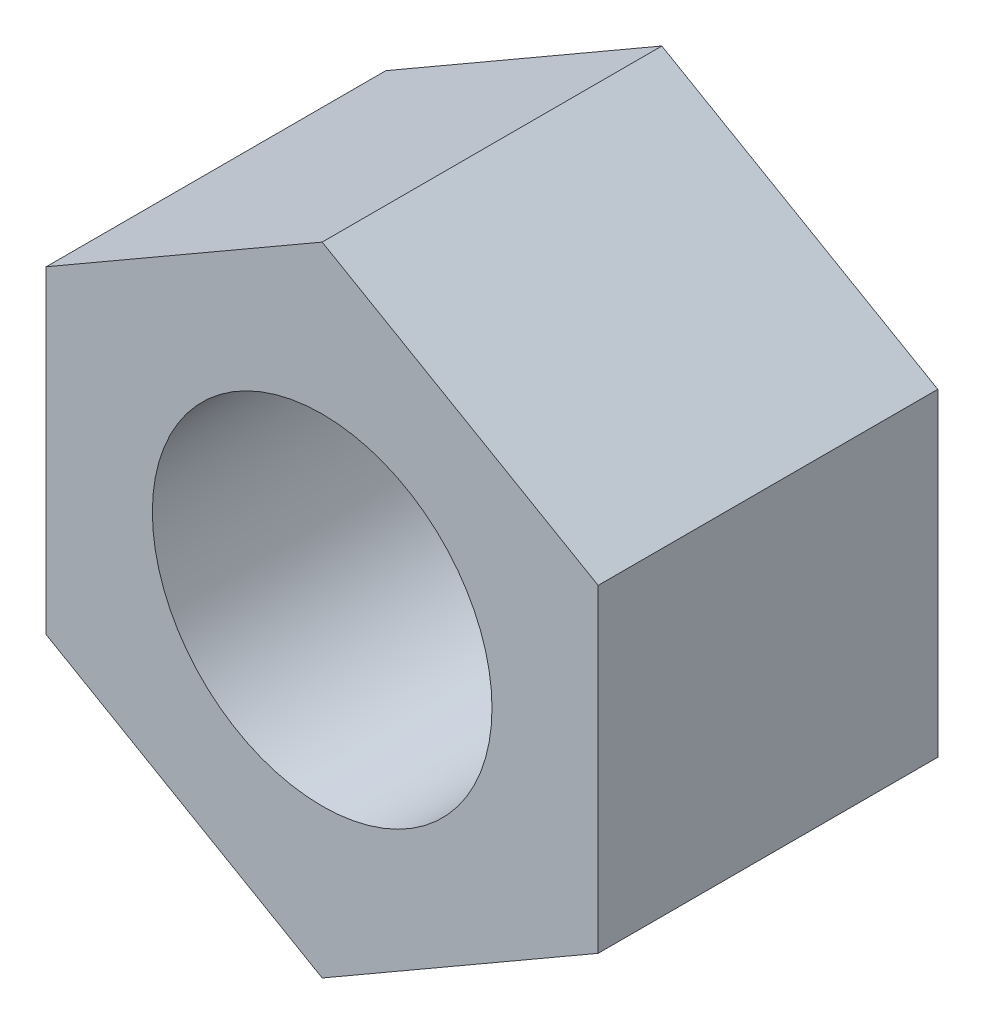
ISO-10303-21;
HEADER;
FILE_DESCRIPTION(('STEP AP214'),'2;1');
FILE_NAME('part.step','',(''),(''),'','','');
FILE_SCHEMA(('AUTOMOTIVE_DESIGN { 1 0 10303 214 1 1 1 1 }'));
ENDSEC;
DATA;
#1=APPLICATION_CONTEXT('core data for automotive mechanical design processes');
#2=APPLICATION_PROTOCOL_DEFINITION('international standard','automotive_design',2000,#1);
#3=PRODUCT_CONTEXT('',#1,'mechanical');
#4=PRODUCT('Part','Part','',(#3));
#5=PRODUCT_RELATED_PRODUCT_CATEGORY('part','',(#4));
#6=PRODUCT_DEFINITION_FORMATION('','',#4);
#7=PRODUCT_DEFINITION_CONTEXT('part definition',#1,'design');
#8=PRODUCT_DEFINITION('design','',#6,#7);
#9=PRODUCT_DEFINITION_SHAPE('','',#8);
#10=(LENGTH_UNIT() NAMED_UNIT(*) SI_UNIT(.MILLI.,.METRE.));
#11=(NAMED_UNIT(*) PLANE_ANGLE_UNIT() SI_UNIT($,.RADIAN.));
#12=(NAMED_UNIT(*) SI_UNIT($,.STERADIAN.) SOLID_ANGLE_UNIT());
#13=UNCERTAINTY_MEASURE_WITH_UNIT(LENGTH_MEASURE(1.E-05),#10,'distance_accuracy_value','');
#14=(GEOMETRIC_REPRESENTATION_CONTEXT(3) GLOBAL_UNCERTAINTY_ASSIGNED_CONTEXT((#13)) GLOBAL_UNIT_ASSIGNED_CONTEXT((#10,
#11,#12)) REPRESENTATION_CONTEXT('',''));
#15=CARTESIAN_POINT('',(0.,0.,0.));
#16=DIRECTION('',(0.,0.,1.));
#17=DIRECTION('',(1.,0.,0.));
#18=AXIS2_PLACEMENT_3D('',#15,#16,#17);
#19=CARTESIAN_POINT('',(6.5,3.75277674973257,8.));
#20=DIRECTION('',(0.,0.,-1.));
#21=DIRECTION('',(-1.,0.,0.));
#22=AXIS2_PLACEMENT_3D('',#19,#20,#21);
#23=PLANE('',#22);
#24=DIRECTION('',(-0.866025403784439,0.5,0.));
#25=VECTOR('',#24,1.);
#26=CARTESIAN_POINT('',(6.5,3.75277674973257,8.));
#27=LINE('',#26,#25);
#28=CARTESIAN_POINT('',(6.5,3.75277674973257,8.));
#29=VERTEX_POINT('',#28);
#30=CARTESIAN_POINT('',(0.,7.50555349946514,8.));
#31=VERTEX_POINT('',#30);
#32=EDGE_CURVE('E130',#29,#31,#27,.T.);
#33=ORIENTED_EDGE('',*,*,#32,.T.);
#34=DIRECTION('',(-0.866025403784439,-0.5,0.));
#35=VECTOR('',#34,1.);
#36=CARTESIAN_POINT('',(0.,7.50555349946514,8.));
#37=LINE('',#36,#35);
#38=CARTESIAN_POINT('',(-6.5,3.75277674973257,8.));
#39=VERTEX_POINT('',#38);
#40=EDGE_CURVE('E88',#31,#39,#37,.T.);
#41=ORIENTED_EDGE('',*,*,#40,.T.);
#42=DIRECTION('',(0.,-1.,0.));
#43=VECTOR('',#42,1.);
#44=CARTESIAN_POINT('',(-6.5,3.75277674973257,8.));
#45=LINE('',#44,#43);
#46=CARTESIAN_POINT('',(-6.5,-3.75277674973257,8.));
#47=VERTEX_POINT('',#46);
#48=EDGE_CURVE('E101',#39,#47,#45,.T.);
#49=ORIENTED_EDGE('',*,*,#48,.T.);
#50=DIRECTION('',(0.866025403784439,-0.5,0.));
#51=VECTOR('',#50,1.);
#52=CARTESIAN_POINT('',(-6.5,-3.75277674973257,8.));
#53=LINE('',#52,#51);
#54=CARTESIAN_POINT('',(0.,-7.50555349946513,8.));
#55=VERTEX_POINT('',#54);
#56=EDGE_CURVE('E95',#47,#55,#53,.T.);
#57=ORIENTED_EDGE('',*,*,#56,.T.);
#58=DIRECTION('',(0.866025403784439,0.5,0.));
#59=VECTOR('',#58,1.);
#60=CARTESIAN_POINT('',(0.,-7.50555349946513,8.));
#61=LINE('',#60,#59);
#62=CARTESIAN_POINT('',(6.5,-3.75277674973257,8.));
#63=VERTEX_POINT('',#62);
#64=EDGE_CURVE('E99',#55,#63,#61,.T.);
#65=ORIENTED_EDGE('',*,*,#64,.T.);
#66=DIRECTION('',(0.,1.,0.));
#67=VECTOR('',#66,1.);
#68=CARTESIAN_POINT('',(6.5,-3.75277674973257,8.));
#69=LINE('',#68,#67);
#70=EDGE_CURVE('E51',#63,#29,#69,.T.);
#71=ORIENTED_EDGE('',*,*,#70,.T.);
#72=EDGE_LOOP('',(#33,#41,#49,#57,#65,#71));
#73=FACE_BOUND('',#72,.T.);
#74=CARTESIAN_POINT('',(0.,0.,8.));
#75=DIRECTION('',(0.,0.,1.));
#76=DIRECTION('',(1.,0.,0.));
#77=AXIS2_PLACEMENT_3D('',#74,#75,#76);
#78=CIRCLE('',#77,4.);
#79=CARTESIAN_POINT('',(4.,0.,8.));
#80=VERTEX_POINT('',#79);
#81=EDGE_CURVE('E123',#80,#80,#78,.T.);
#82=ORIENTED_EDGE('',*,*,#81,.F.);
#83=EDGE_LOOP('',(#82));
#84=FACE_BOUND('',#83,.T.);
#85=ADVANCED_FACE('F34',(#73,#84),#23,.F.);
#86=CARTESIAN_POINT('',(6.5,3.75277674973257,0.));
#87=DIRECTION('',(0.,0.,-1.));
#88=DIRECTION('',(-1.,0.,0.));
#89=AXIS2_PLACEMENT_3D('',#86,#87,#88);
#90=PLANE('',#89);
#91=DIRECTION('',(-0.866025403784439,0.5,0.));
#92=VECTOR('',#91,1.);
#93=CARTESIAN_POINT('',(6.5,3.75277674973257,0.));
#94=LINE('',#93,#92);
#95=CARTESIAN_POINT('',(6.5,3.75277674973257,0.));
#96=VERTEX_POINT('',#95);
#97=CARTESIAN_POINT('',(0.,7.50555349946514,0.));
#98=VERTEX_POINT('',#97);
#99=EDGE_CURVE('E119',#96,#98,#94,.T.);
#100=ORIENTED_EDGE('',*,*,#99,.F.);
#101=DIRECTION('',(0.,1.,0.));
#102=VECTOR('',#101,1.);
#103=CARTESIAN_POINT('',(6.5,-3.75277674973257,0.));
#104=LINE('',#103,#102);
#105=CARTESIAN_POINT('',(6.5,-3.75277674973257,0.));
#106=VERTEX_POINT('',#105);
#107=EDGE_CURVE('E80',#106,#96,#104,.T.);
#108=ORIENTED_EDGE('',*,*,#107,.F.);
#109=DIRECTION('',(0.866025403784439,0.5,0.));
#110=VECTOR('',#109,1.);
#111=CARTESIAN_POINT('',(0.,-7.50555349946513,0.));
#112=LINE('',#111,#110);
#113=CARTESIAN_POINT('',(0.,-7.50555349946513,0.));
#114=VERTEX_POINT('',#113);
#115=EDGE_CURVE('E74',#114,#106,#112,.T.);
#116=ORIENTED_EDGE('',*,*,#115,.F.);
#117=DIRECTION('',(0.866025403784439,-0.5,0.));
#118=VECTOR('',#117,1.);
#119=CARTESIAN_POINT('',(-6.5,-3.75277674973257,0.));
#120=LINE('',#119,#118);
#121=CARTESIAN_POINT('',(-6.5,-3.75277674973257,0.));
#122=VERTEX_POINT('',#121);
#123=EDGE_CURVE('E109',#122,#114,#120,.T.);
#124=ORIENTED_EDGE('',*,*,#123,.F.);
#125=DIRECTION('',(0.,-1.,0.));
#126=VECTOR('',#125,1.);
#127=CARTESIAN_POINT('',(-6.5,3.75277674973257,0.));
#128=LINE('',#127,#126);
#129=CARTESIAN_POINT('',(-6.5,3.75277674973257,0.));
#130=VERTEX_POINT('',#129);
#131=EDGE_CURVE('E125',#130,#122,#128,.T.);
#132=ORIENTED_EDGE('',*,*,#131,.F.);
#133=DIRECTION('',(-0.866025403784439,-0.5,0.));
#134=VECTOR('',#133,1.);
#135=CARTESIAN_POINT('',(0.,7.50555349946514,0.));
#136=LINE('',#135,#134);
#137=EDGE_CURVE('E122',#98,#130,#136,.T.);
#138=ORIENTED_EDGE('',*,*,#137,.F.);
#139=EDGE_LOOP('',(#100,#108,#116,#124,#132,#138));
#140=FACE_BOUND('',#139,.T.);
#141=CARTESIAN_POINT('',(0.,0.,0.));
#142=DIRECTION('',(0.,0.,1.));
#143=DIRECTION('',(1.,0.,0.));
#144=AXIS2_PLACEMENT_3D('',#141,#142,#143);
#145=CIRCLE('',#144,4.);
#146=CARTESIAN_POINT('',(4.,0.,0.));
#147=VERTEX_POINT('',#146);
#148=EDGE_CURVE('E223',#147,#147,#145,.T.);
#149=ORIENTED_EDGE('',*,*,#148,.T.);
#150=EDGE_LOOP('',(#149));
#151=FACE_BOUND('',#150,.T.);
#152=ADVANCED_FACE('F139',(#140,#151),#90,.T.);
#153=CARTESIAN_POINT('',(6.5,3.75277674973257,8.));
#154=DIRECTION('',(-0.5,-0.866025403784439,0.));
#155=DIRECTION('',(0.866025403784439,-0.5,0.));
#156=AXIS2_PLACEMENT_3D('',#153,#154,#155);
#157=PLANE('',#156);
#158=ORIENTED_EDGE('',*,*,#99,.T.);
#159=DIRECTION('',(0.,0.,-1.));
#160=VECTOR('',#159,1.);
#161=CARTESIAN_POINT('',(0.,7.50555349946514,8.));
#162=LINE('',#161,#160);
#163=EDGE_CURVE('E11',#31,#98,#162,.T.);
#164=ORIENTED_EDGE('',*,*,#163,.F.);
#165=ORIENTED_EDGE('',*,*,#32,.F.);
#166=DIRECTION('',(0.,0.,-1.));
#167=VECTOR('',#166,1.);
#168=CARTESIAN_POINT('',(6.5,3.75277674973257,8.));
#169=LINE('',#168,#167);
#170=EDGE_CURVE('E115',#29,#96,#169,.T.);
#171=ORIENTED_EDGE('',*,*,#170,.T.);
#172=EDGE_LOOP('',(#158,#164,#165,#171));
#173=FACE_BOUND('',#172,.T.);
#174=ADVANCED_FACE('F36',(#173),#157,.F.);
#175=CARTESIAN_POINT('',(0.,7.50555349946514,8.));
#176=DIRECTION('',(0.5,-0.866025403784439,0.));
#177=DIRECTION('',(0.866025403784439,0.5,0.));
#178=AXIS2_PLACEMENT_3D('',#175,#176,#177);
#179=PLANE('',#178);
#180=ORIENTED_EDGE('',*,*,#137,.T.);
#181=DIRECTION('',(0.,0.,-1.));
#182=VECTOR('',#181,1.);
#183=CARTESIAN_POINT('',(-6.5,3.75277674973257,8.));
#184=LINE('',#183,#182);
#185=EDGE_CURVE('E43',#39,#130,#184,.T.);
#186=ORIENTED_EDGE('',*,*,#185,.F.);
#187=ORIENTED_EDGE('',*,*,#40,.F.);
#188=ORIENTED_EDGE('',*,*,#163,.T.);
#189=EDGE_LOOP('',(#180,#186,#187,#188));
#190=FACE_BOUND('',#189,.T.);
#191=ADVANCED_FACE('F164',(#190),#179,.F.);
#192=CARTESIAN_POINT('',(-6.5,3.75277674973257,8.));
#193=DIRECTION('',(1.,0.,0.));
#194=DIRECTION('',(0.,0.,-1.));
#195=AXIS2_PLACEMENT_3D('',#192,#193,#194);
#196=PLANE('',#195);
#197=ORIENTED_EDGE('',*,*,#131,.T.);
#198=DIRECTION('',(0.,0.,-1.));
#199=VECTOR('',#198,1.);
#200=CARTESIAN_POINT('',(-6.5,-3.75277674973257,8.));
#201=LINE('',#200,#199);
#202=EDGE_CURVE('E110',#47,#122,#201,.T.);
#203=ORIENTED_EDGE('',*,*,#202,.F.);
#204=ORIENTED_EDGE('',*,*,#48,.F.);
#205=ORIENTED_EDGE('',*,*,#185,.T.);
#206=EDGE_LOOP('',(#197,#203,#204,#205));
#207=FACE_BOUND('',#206,.T.);
#208=ADVANCED_FACE('F136',(#207),#196,.F.);
#209=CARTESIAN_POINT('',(-6.5,-3.75277674973257,8.));
#210=DIRECTION('',(0.5,0.866025403784439,0.));
#211=DIRECTION('',(-0.866025403784439,0.5,0.));
#212=AXIS2_PLACEMENT_3D('',#209,#210,#211);
#213=PLANE('',#212);
#214=ORIENTED_EDGE('',*,*,#123,.T.);
#215=DIRECTION('',(0.,0.,-1.));
#216=VECTOR('',#215,1.);
#217=CARTESIAN_POINT('',(0.,-7.50555349946513,8.));
#218=LINE('',#217,#216);
#219=EDGE_CURVE('E106',#55,#114,#218,.T.);
#220=ORIENTED_EDGE('',*,*,#219,.F.);
#221=ORIENTED_EDGE('',*,*,#56,.F.);
#222=ORIENTED_EDGE('',*,*,#202,.T.);
#223=EDGE_LOOP('',(#214,#220,#221,#222));
#224=FACE_BOUND('',#223,.T.);
#225=ADVANCED_FACE('F107',(#224),#213,.F.);
#226=CARTESIAN_POINT('',(0.,-7.50555349946513,8.));
#227=DIRECTION('',(-0.5,0.866025403784439,0.));
#228=DIRECTION('',(-0.866025403784439,-0.5,0.));
#229=AXIS2_PLACEMENT_3D('',#226,#227,#228);
#230=PLANE('',#229);
#231=ORIENTED_EDGE('',*,*,#115,.T.);
#232=DIRECTION('',(0.,0.,-1.));
#233=VECTOR('',#232,1.);
#234=CARTESIAN_POINT('',(6.5,-3.75277674973257,8.));
#235=LINE('',#234,#233);
#236=EDGE_CURVE('E111',#63,#106,#235,.T.);
#237=ORIENTED_EDGE('',*,*,#236,.F.);
#238=ORIENTED_EDGE('',*,*,#64,.F.);
#239=ORIENTED_EDGE('',*,*,#219,.T.);
#240=EDGE_LOOP('',(#231,#237,#238,#239));
#241=FACE_BOUND('',#240,.T.);
#242=ADVANCED_FACE('F113',(#241),#230,.F.);
#243=CARTESIAN_POINT('',(6.5,-3.75277674973257,8.));
#244=DIRECTION('',(-1.,0.,0.));
#245=DIRECTION('',(0.,0.,1.));
#246=AXIS2_PLACEMENT_3D('',#243,#244,#245);
#247=PLANE('',#246);
#248=ORIENTED_EDGE('',*,*,#107,.T.);
#249=ORIENTED_EDGE('',*,*,#170,.F.);
#250=ORIENTED_EDGE('',*,*,#70,.F.);
#251=ORIENTED_EDGE('',*,*,#236,.T.);
#252=EDGE_LOOP('',(#248,#249,#250,#251));
#253=FACE_BOUND('',#252,.T.);
#254=ADVANCED_FACE('F144',(#253),#247,.F.);
#255=CARTESIAN_POINT('',(0.,0.,8.));
#256=DIRECTION('',(0.,0.,-1.));
#257=DIRECTION('',(-1.,0.,0.));
#258=AXIS2_PLACEMENT_3D('',#255,#256,#257);
#259=CYLINDRICAL_SURFACE('',#258,4.);
#260=ORIENTED_EDGE('',*,*,#81,.T.);
#261=EDGE_LOOP('',(#260));
#262=FACE_BOUND('',#261,.T.);
#263=ORIENTED_EDGE('',*,*,#148,.F.);
#264=EDGE_LOOP('',(#263));
#265=FACE_BOUND('',#264,.T.);
#266=ADVANCED_FACE('F146',(#262,#265),#259,.F.);
#267=CLOSED_SHELL('',(#85,#152,#174,#191,#208,#225,#242,#254,#266));
#268=MANIFOLD_SOLID_BREP('B2',#267);
#269=ADVANCED_BREP_SHAPE_REPRESENTATION('',(#18,#268),#14);
#270=SHAPE_DEFINITION_REPRESENTATION(#9,#269);
ENDSEC;
END-ISO-10303-21;
